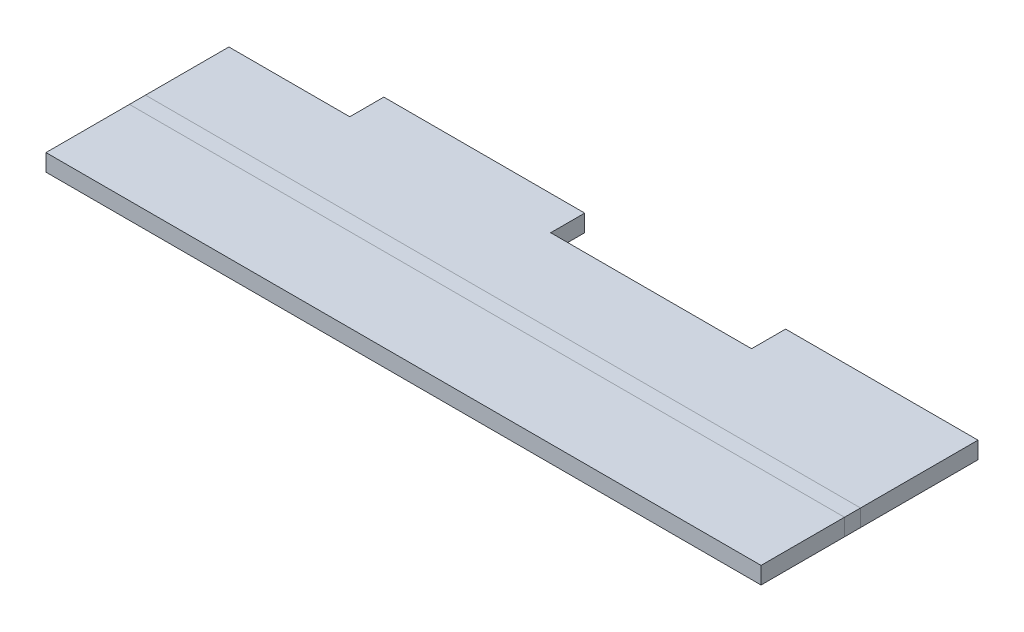
ISO-10303-21;
HEADER;
FILE_DESCRIPTION(('STEP AP214'),'2;1');
FILE_NAME('part.step','',(''),(''),'','','');
FILE_SCHEMA(('AUTOMOTIVE_DESIGN { 1 0 10303 214 1 1 1 1 }'));
ENDSEC;
DATA;
#1=APPLICATION_CONTEXT('core data for automotive mechanical design processes');
#2=APPLICATION_PROTOCOL_DEFINITION('international standard','automotive_design',2000,#1);
#3=PRODUCT_CONTEXT('',#1,'mechanical');
#4=PRODUCT('Part','Part','',(#3));
#5=PRODUCT_RELATED_PRODUCT_CATEGORY('part','',(#4));
#6=PRODUCT_DEFINITION_FORMATION('','',#4);
#7=PRODUCT_DEFINITION_CONTEXT('part definition',#1,'design');
#8=PRODUCT_DEFINITION('design','',#6,#7);
#9=PRODUCT_DEFINITION_SHAPE('','',#8);
#10=(LENGTH_UNIT() NAMED_UNIT(*) SI_UNIT(.MILLI.,.METRE.));
#11=(NAMED_UNIT(*) PLANE_ANGLE_UNIT() SI_UNIT($,.RADIAN.));
#12=(NAMED_UNIT(*) SI_UNIT($,.STERADIAN.) SOLID_ANGLE_UNIT());
#13=UNCERTAINTY_MEASURE_WITH_UNIT(LENGTH_MEASURE(1.E-05),#10,'distance_accuracy_value','');
#14=(GEOMETRIC_REPRESENTATION_CONTEXT(3) GLOBAL_UNCERTAINTY_ASSIGNED_CONTEXT((#13)) GLOBAL_UNIT_ASSIGNED_CONTEXT((#10,
#11,#12)) REPRESENTATION_CONTEXT('',''));
#15=CARTESIAN_POINT('',(0.,0.,0.));
#16=DIRECTION('',(0.,0.,1.));
#17=DIRECTION('',(1.,0.,0.));
#18=AXIS2_PLACEMENT_3D('',#15,#16,#17);
#19=CARTESIAN_POINT('',(5.334,2.032,-1.96658936020354));
#20=DIRECTION('',(1.,0.,0.));
#21=DIRECTION('',(0.,0.,1.));
#22=AXIS2_PLACEMENT_3D('',#19,#20,#21);
#23=PLANE('',#22);
#24=DIRECTION('',(0.,1.,0.));
#25=VECTOR('',#24,1.);
#26=CARTESIAN_POINT('',(5.334,2.032,-0.213989360203542));
#27=LINE('',#26,#25);
#28=CARTESIAN_POINT('',(5.334,1.778,-0.213989360203542));
#29=VERTEX_POINT('',#28);
#30=CARTESIAN_POINT('',(5.334,2.032,-0.213989360203542));
#31=VERTEX_POINT('',#30);
#32=EDGE_CURVE('E11',#29,#31,#27,.T.);
#33=ORIENTED_EDGE('',*,*,#32,.F.);
#34=DIRECTION('',(0.,0.,1.));
#35=VECTOR('',#34,1.);
#36=CARTESIAN_POINT('',(5.334,1.778,-1.96658936020354));
#37=LINE('',#36,#35);
#38=CARTESIAN_POINT('',(5.334,1.778,-1.96658936020354));
#39=VERTEX_POINT('',#38);
#40=EDGE_CURVE('E55',#39,#29,#37,.T.);
#41=ORIENTED_EDGE('',*,*,#40,.F.);
#42=DIRECTION('',(0.,1.,0.));
#43=VECTOR('',#42,1.);
#44=CARTESIAN_POINT('',(5.334,2.032,-1.96658936020354));
#45=LINE('',#44,#43);
#46=CARTESIAN_POINT('',(5.334,2.032,-1.96658936020354));
#47=VERTEX_POINT('',#46);
#48=EDGE_CURVE('E265',#39,#47,#45,.T.);
#49=ORIENTED_EDGE('',*,*,#48,.T.);
#50=DIRECTION('',(0.,0.,1.));
#51=VECTOR('',#50,1.);
#52=CARTESIAN_POINT('',(5.334,2.032,-1.96658936020354));
#53=LINE('',#52,#51);
#54=EDGE_CURVE('E214',#47,#31,#53,.T.);
#55=ORIENTED_EDGE('',*,*,#54,.T.);
#56=EDGE_LOOP('',(#33,#41,#49,#55));
#57=FACE_BOUND('',#56,.T.);
#58=ADVANCED_FACE('F41',(#57),#23,.T.);
#59=CARTESIAN_POINT('',(5.334,2.032,-1.96658936020354));
#60=DIRECTION('',(0.,0.,1.));
#61=DIRECTION('',(-1.,0.,0.));
#62=AXIS2_PLACEMENT_3D('',#59,#60,#61);
#63=PLANE('',#62);
#64=ORIENTED_EDGE('',*,*,#48,.F.);
#65=DIRECTION('',(1.,0.,0.));
#66=VECTOR('',#65,1.);
#67=CARTESIAN_POINT('',(5.334,1.778,-1.96658936020354));
#68=LINE('',#67,#66);
#69=CARTESIAN_POINT('',(2.46380000000005,1.778,-1.96658936020354));
#70=VERTEX_POINT('',#69);
#71=EDGE_CURVE('E247',#39,#70,#68,.F.);
#72=ORIENTED_EDGE('',*,*,#71,.T.);
#73=DIRECTION('',(0.,1.,0.));
#74=VECTOR('',#73,1.);
#75=CARTESIAN_POINT('',(2.46380000000005,2.032,-1.96658936020354));
#76=LINE('',#75,#74);
#77=CARTESIAN_POINT('',(2.46380000000005,2.032,-1.96658936020354));
#78=VERTEX_POINT('',#77);
#79=EDGE_CURVE('E263',#70,#78,#76,.T.);
#80=ORIENTED_EDGE('',*,*,#79,.T.);
#81=DIRECTION('',(-1.,0.,0.));
#82=VECTOR('',#81,1.);
#83=CARTESIAN_POINT('',(5.334,2.032,-1.96658936020354));
#84=LINE('',#83,#82);
#85=EDGE_CURVE('E217',#47,#78,#84,.T.);
#86=ORIENTED_EDGE('',*,*,#85,.F.);
#87=EDGE_LOOP('',(#64,#72,#80,#86));
#88=FACE_BOUND('',#87,.T.);
#89=ADVANCED_FACE('F298',(#88),#63,.F.);
#90=CARTESIAN_POINT('',(2.46380000000005,2.032,-1.96658936020354));
#91=DIRECTION('',(-1.,0.,0.));
#92=DIRECTION('',(0.,0.,-1.));
#93=AXIS2_PLACEMENT_3D('',#90,#91,#92);
#94=PLANE('',#93);
#95=ORIENTED_EDGE('',*,*,#79,.F.);
#96=DIRECTION('',(0.,0.,1.));
#97=VECTOR('',#96,1.);
#98=CARTESIAN_POINT('',(2.46380000000005,1.778,-1.96658936020354));
#99=LINE('',#98,#97);
#100=CARTESIAN_POINT('',(2.46380000000005,1.778,-1.45858936020354));
#101=VERTEX_POINT('',#100);
#102=EDGE_CURVE('E244',#101,#70,#99,.F.);
#103=ORIENTED_EDGE('',*,*,#102,.F.);
#104=DIRECTION('',(0.,1.,0.));
#105=VECTOR('',#104,1.);
#106=CARTESIAN_POINT('',(2.46380000000005,2.032,-1.45858936020354));
#107=LINE('',#106,#105);
#108=CARTESIAN_POINT('',(2.46380000000005,2.032,-1.45858936020354));
#109=VERTEX_POINT('',#108);
#110=EDGE_CURVE('E261',#101,#109,#107,.T.);
#111=ORIENTED_EDGE('',*,*,#110,.T.);
#112=DIRECTION('',(0.,0.,-1.));
#113=VECTOR('',#112,1.);
#114=CARTESIAN_POINT('',(2.46380000000005,2.032,-1.96658936020354));
#115=LINE('',#114,#113);
#116=EDGE_CURVE('E220',#109,#78,#115,.T.);
#117=ORIENTED_EDGE('',*,*,#116,.T.);
#118=EDGE_LOOP('',(#95,#103,#111,#117));
#119=FACE_BOUND('',#118,.T.);
#120=ADVANCED_FACE('F303',(#119),#94,.T.);
#121=CARTESIAN_POINT('',(2.46380000000005,2.032,-1.45858936020354));
#122=DIRECTION('',(0.,0.,-1.));
#123=DIRECTION('',(1.,0.,0.));
#124=AXIS2_PLACEMENT_3D('',#121,#122,#123);
#125=PLANE('',#124);
#126=ORIENTED_EDGE('',*,*,#110,.F.);
#127=DIRECTION('',(1.,0.,0.));
#128=VECTOR('',#127,1.);
#129=CARTESIAN_POINT('',(5.334,1.778,-1.45858936020354));
#130=LINE('',#129,#128);
#131=CARTESIAN_POINT('',(-0.53339999999995,1.778,-1.45858936020354));
#132=VERTEX_POINT('',#131);
#133=EDGE_CURVE('E241',#132,#101,#130,.T.);
#134=ORIENTED_EDGE('',*,*,#133,.F.);
#135=DIRECTION('',(0.,1.,0.));
#136=VECTOR('',#135,1.);
#137=CARTESIAN_POINT('',(-0.53339999999995,2.032,-1.45858936020354));
#138=LINE('',#137,#136);
#139=CARTESIAN_POINT('',(-0.53339999999995,2.032,-1.45858936020354));
#140=VERTEX_POINT('',#139);
#141=EDGE_CURVE('E259',#132,#140,#138,.T.);
#142=ORIENTED_EDGE('',*,*,#141,.T.);
#143=DIRECTION('',(1.,0.,0.));
#144=VECTOR('',#143,1.);
#145=CARTESIAN_POINT('',(2.46380000000005,2.032,-1.45858936020354));
#146=LINE('',#145,#144);
#147=EDGE_CURVE('E224',#140,#109,#146,.T.);
#148=ORIENTED_EDGE('',*,*,#147,.T.);
#149=EDGE_LOOP('',(#126,#134,#142,#148));
#150=FACE_BOUND('',#149,.T.);
#151=ADVANCED_FACE('F318',(#150),#125,.T.);
#152=CARTESIAN_POINT('',(-0.53339999999995,2.032,-1.96658936020354));
#153=DIRECTION('',(1.,0.,0.));
#154=DIRECTION('',(0.,0.,1.));
#155=AXIS2_PLACEMENT_3D('',#152,#153,#154);
#156=PLANE('',#155);
#157=ORIENTED_EDGE('',*,*,#141,.F.);
#158=DIRECTION('',(0.,0.,1.));
#159=VECTOR('',#158,1.);
#160=CARTESIAN_POINT('',(-0.53339999999995,1.778,-1.96658936020354));
#161=LINE('',#160,#159);
#162=CARTESIAN_POINT('',(-0.53339999999995,1.778,-1.96658936020354));
#163=VERTEX_POINT('',#162);
#164=EDGE_CURVE('E238',#163,#132,#161,.T.);
#165=ORIENTED_EDGE('',*,*,#164,.F.);
#166=DIRECTION('',(0.,1.,0.));
#167=VECTOR('',#166,1.);
#168=CARTESIAN_POINT('',(-0.53339999999995,2.032,-1.96658936020354));
#169=LINE('',#168,#167);
#170=CARTESIAN_POINT('',(-0.53339999999995,2.032,-1.96658936020354));
#171=VERTEX_POINT('',#170);
#172=EDGE_CURVE('E257',#163,#171,#169,.T.);
#173=ORIENTED_EDGE('',*,*,#172,.T.);
#174=DIRECTION('',(0.,0.,1.));
#175=VECTOR('',#174,1.);
#176=CARTESIAN_POINT('',(-0.53339999999995,2.032,-1.96658936020354));
#177=LINE('',#176,#175);
#178=EDGE_CURVE('E227',#171,#140,#177,.T.);
#179=ORIENTED_EDGE('',*,*,#178,.T.);
#180=EDGE_LOOP('',(#157,#165,#173,#179));
#181=FACE_BOUND('',#180,.T.);
#182=ADVANCED_FACE('F324',(#181),#156,.T.);
#183=ORIENTED_EDGE('',*,*,#172,.F.);
#184=DIRECTION('',(1.,0.,0.));
#185=VECTOR('',#184,1.);
#186=CARTESIAN_POINT('',(5.334,1.778,-1.96658936020354));
#187=LINE('',#186,#185);
#188=CARTESIAN_POINT('',(-3.53059999999995,1.778,-1.96658936020354));
#189=VERTEX_POINT('',#188);
#190=EDGE_CURVE('E209',#163,#189,#187,.F.);
#191=ORIENTED_EDGE('',*,*,#190,.T.);
#192=DIRECTION('',(0.,1.,0.));
#193=VECTOR('',#192,1.);
#194=CARTESIAN_POINT('',(-3.53059999999995,2.032,-1.96658936020354));
#195=LINE('',#194,#193);
#196=CARTESIAN_POINT('',(-3.53059999999995,2.032,-1.96658936020354));
#197=VERTEX_POINT('',#196);
#198=EDGE_CURVE('E255',#189,#197,#195,.T.);
#199=ORIENTED_EDGE('',*,*,#198,.T.);
#200=EDGE_CURVE('E221',#171,#197,#84,.T.);
#201=ORIENTED_EDGE('',*,*,#200,.F.);
#202=EDGE_LOOP('',(#183,#191,#199,#201));
#203=FACE_BOUND('',#202,.T.);
#204=ADVANCED_FACE('F306',(#203),#63,.F.);
#205=CARTESIAN_POINT('',(-3.53059999999995,2.032,-1.96658936020354));
#206=DIRECTION('',(-1.,0.,0.));
#207=DIRECTION('',(0.,0.,-1.));
#208=AXIS2_PLACEMENT_3D('',#205,#206,#207);
#209=PLANE('',#208);
#210=ORIENTED_EDGE('',*,*,#198,.F.);
#211=DIRECTION('',(0.,0.,1.));
#212=VECTOR('',#211,1.);
#213=CARTESIAN_POINT('',(-3.53059999999995,1.778,-1.96658936020354));
#214=LINE('',#213,#212);
#215=CARTESIAN_POINT('',(-3.53059999999995,1.778,-1.45858936020354));
#216=VERTEX_POINT('',#215);
#217=EDGE_CURVE('E191',#216,#189,#214,.F.);
#218=ORIENTED_EDGE('',*,*,#217,.F.);
#219=DIRECTION('',(0.,1.,0.));
#220=VECTOR('',#219,1.);
#221=CARTESIAN_POINT('',(-3.53059999999995,2.032,-1.45858936020354));
#222=LINE('',#221,#220);
#223=CARTESIAN_POINT('',(-3.53059999999995,2.032,-1.45858936020354));
#224=VERTEX_POINT('',#223);
#225=EDGE_CURVE('E253',#216,#224,#222,.T.);
#226=ORIENTED_EDGE('',*,*,#225,.T.);
#227=DIRECTION('',(0.,0.,-1.));
#228=VECTOR('',#227,1.);
#229=CARTESIAN_POINT('',(-3.53059999999995,2.032,-1.96658936020354));
#230=LINE('',#229,#228);
#231=EDGE_CURVE('E205',#224,#197,#230,.T.);
#232=ORIENTED_EDGE('',*,*,#231,.T.);
#233=EDGE_LOOP('',(#210,#218,#226,#232));
#234=FACE_BOUND('',#233,.T.);
#235=ADVANCED_FACE('F328',(#234),#209,.T.);
#236=CARTESIAN_POINT('',(-5.334,2.032,-1.45858936020354));
#237=DIRECTION('',(0.,0.,-1.));
#238=DIRECTION('',(1.,0.,0.));
#239=AXIS2_PLACEMENT_3D('',#236,#237,#238);
#240=PLANE('',#239);
#241=ORIENTED_EDGE('',*,*,#225,.F.);
#242=DIRECTION('',(1.,0.,0.));
#243=VECTOR('',#242,1.);
#244=CARTESIAN_POINT('',(5.334,1.778,-1.45858936020354));
#245=LINE('',#244,#243);
#246=CARTESIAN_POINT('',(-5.334,1.778,-1.45858936020354));
#247=VERTEX_POINT('',#246);
#248=EDGE_CURVE('E231',#247,#216,#245,.T.);
#249=ORIENTED_EDGE('',*,*,#248,.F.);
#250=DIRECTION('',(0.,1.,0.));
#251=VECTOR('',#250,1.);
#252=CARTESIAN_POINT('',(-5.334,2.032,-1.45858936020354));
#253=LINE('',#252,#251);
#254=CARTESIAN_POINT('',(-5.334,2.032,-1.45858936020354));
#255=VERTEX_POINT('',#254);
#256=EDGE_CURVE('E251',#247,#255,#253,.T.);
#257=ORIENTED_EDGE('',*,*,#256,.T.);
#258=DIRECTION('',(1.,0.,0.));
#259=VECTOR('',#258,1.);
#260=CARTESIAN_POINT('',(-5.334,2.032,-1.45858936020354));
#261=LINE('',#260,#259);
#262=EDGE_CURVE('E208',#255,#224,#261,.T.);
#263=ORIENTED_EDGE('',*,*,#262,.T.);
#264=EDGE_LOOP('',(#241,#249,#257,#263));
#265=FACE_BOUND('',#264,.T.);
#266=ADVANCED_FACE('F331',(#265),#240,.T.);
#267=CARTESIAN_POINT('',(-5.334,2.032,-1.96658936020354));
#268=DIRECTION('',(1.,0.,0.));
#269=DIRECTION('',(0.,0.,1.));
#270=AXIS2_PLACEMENT_3D('',#267,#268,#269);
#271=PLANE('',#270);
#272=ORIENTED_EDGE('',*,*,#256,.F.);
#273=DIRECTION('',(0.,0.,1.));
#274=VECTOR('',#273,1.);
#275=CARTESIAN_POINT('',(-5.334,1.778,-1.96658936020354));
#276=LINE('',#275,#274);
#277=CARTESIAN_POINT('',(-5.334,1.778,-0.213989360203542));
#278=VERTEX_POINT('',#277);
#279=EDGE_CURVE('E63',#247,#278,#276,.T.);
#280=ORIENTED_EDGE('',*,*,#279,.T.);
#281=DIRECTION('',(0.,1.,0.));
#282=VECTOR('',#281,1.);
#283=CARTESIAN_POINT('',(-5.334,2.032,-0.213989360203542));
#284=LINE('',#283,#282);
#285=CARTESIAN_POINT('',(-5.334,2.032,-0.213989360203542));
#286=VERTEX_POINT('',#285);
#287=EDGE_CURVE('E268',#278,#286,#284,.T.);
#288=ORIENTED_EDGE('',*,*,#287,.T.);
#289=DIRECTION('',(0.,0.,1.));
#290=VECTOR('',#289,1.);
#291=CARTESIAN_POINT('',(-5.334,2.032,-1.96658936020354));
#292=LINE('',#291,#290);
#293=EDGE_CURVE('E212',#255,#286,#292,.T.);
#294=ORIENTED_EDGE('',*,*,#293,.F.);
#295=EDGE_LOOP('',(#272,#280,#288,#294));
#296=FACE_BOUND('',#295,.T.);
#297=ADVANCED_FACE('F332',(#296),#271,.F.);
#298=CARTESIAN_POINT('',(5.334,2.032,-1.96658936020354));
#299=DIRECTION('',(0.,-1.,0.));
#300=DIRECTION('',(1.,0.,0.));
#301=AXIS2_PLACEMENT_3D('',#298,#299,#300);
#302=PLANE('',#301);
#303=ORIENTED_EDGE('',*,*,#231,.F.);
#304=ORIENTED_EDGE('',*,*,#262,.F.);
#305=ORIENTED_EDGE('',*,*,#293,.T.);
#306=DIRECTION('',(-1.,0.,0.));
#307=VECTOR('',#306,1.);
#308=CARTESIAN_POINT('',(5.334,2.032,-0.213989360203542));
#309=LINE('',#308,#307);
#310=EDGE_CURVE('E181',#31,#286,#309,.T.);
#311=ORIENTED_EDGE('',*,*,#310,.F.);
#312=ORIENTED_EDGE('',*,*,#54,.F.);
#313=ORIENTED_EDGE('',*,*,#85,.T.);
#314=ORIENTED_EDGE('',*,*,#116,.F.);
#315=ORIENTED_EDGE('',*,*,#147,.F.);
#316=ORIENTED_EDGE('',*,*,#178,.F.);
#317=ORIENTED_EDGE('',*,*,#200,.T.);
#318=EDGE_LOOP('',(#303,#304,#305,#311,#312,#313,#314,#315,#316,#317));
#319=FACE_BOUND('',#318,.T.);
#320=ADVANCED_FACE('F294',(#319),#302,.F.);
#321=CARTESIAN_POINT('',(5.334,1.778,-1.96658936020354));
#322=DIRECTION('',(0.,-1.,0.));
#323=DIRECTION('',(1.,0.,0.));
#324=AXIS2_PLACEMENT_3D('',#321,#322,#323);
#325=PLANE('',#324);
#326=ORIENTED_EDGE('',*,*,#217,.T.);
#327=ORIENTED_EDGE('',*,*,#190,.F.);
#328=ORIENTED_EDGE('',*,*,#164,.T.);
#329=ORIENTED_EDGE('',*,*,#133,.T.);
#330=ORIENTED_EDGE('',*,*,#102,.T.);
#331=ORIENTED_EDGE('',*,*,#71,.F.);
#332=ORIENTED_EDGE('',*,*,#40,.T.);
#333=DIRECTION('',(-1.,0.,0.));
#334=VECTOR('',#333,1.);
#335=CARTESIAN_POINT('',(5.334,1.778,-0.213989360203542));
#336=LINE('',#335,#334);
#337=EDGE_CURVE('E48',#29,#278,#336,.T.);
#338=ORIENTED_EDGE('',*,*,#337,.T.);
#339=ORIENTED_EDGE('',*,*,#279,.F.);
#340=ORIENTED_EDGE('',*,*,#248,.T.);
#341=EDGE_LOOP('',(#326,#327,#328,#329,#330,#331,#332,#338,#339,#340));
#342=FACE_BOUND('',#341,.T.);
#343=ADVANCED_FACE('F270',(#342),#325,.T.);
#344=CARTESIAN_POINT('',(5.334,2.032,1.27));
#345=DIRECTION('',(0.,0.,1.));
#346=DIRECTION('',(-1.,0.,0.));
#347=AXIS2_PLACEMENT_3D('',#344,#345,#346);
#348=PLANE('',#347);
#349=DIRECTION('',(0.,1.,0.));
#350=VECTOR('',#349,1.);
#351=CARTESIAN_POINT('',(-5.334,2.032,1.27));
#352=LINE('',#351,#350);
#353=CARTESIAN_POINT('',(-5.334,1.778,1.27));
#354=VERTEX_POINT('',#353);
#355=CARTESIAN_POINT('',(-5.334,2.032,1.27));
#356=VERTEX_POINT('',#355);
#357=EDGE_CURVE('E165',#354,#356,#352,.T.);
#358=ORIENTED_EDGE('',*,*,#357,.F.);
#359=DIRECTION('',(1.,0.,0.));
#360=VECTOR('',#359,1.);
#361=CARTESIAN_POINT('',(5.334,1.778,1.27));
#362=LINE('',#361,#360);
#363=CARTESIAN_POINT('',(5.334,1.778,1.27));
#364=VERTEX_POINT('',#363);
#365=EDGE_CURVE('E194',#364,#354,#362,.F.);
#366=ORIENTED_EDGE('',*,*,#365,.F.);
#367=DIRECTION('',(0.,1.,0.));
#368=VECTOR('',#367,1.);
#369=CARTESIAN_POINT('',(5.334,2.032,1.27));
#370=LINE('',#369,#368);
#371=CARTESIAN_POINT('',(5.334,2.032,1.27));
#372=VERTEX_POINT('',#371);
#373=EDGE_CURVE('E177',#364,#372,#370,.T.);
#374=ORIENTED_EDGE('',*,*,#373,.T.);
#375=DIRECTION('',(-1.,0.,0.));
#376=VECTOR('',#375,1.);
#377=CARTESIAN_POINT('',(5.334,2.032,1.27));
#378=LINE('',#377,#376);
#379=EDGE_CURVE('E166',#372,#356,#378,.T.);
#380=ORIENTED_EDGE('',*,*,#379,.T.);
#381=EDGE_LOOP('',(#358,#366,#374,#380));
#382=FACE_BOUND('',#381,.T.);
#383=ADVANCED_FACE('F286',(#382),#348,.T.);
#384=CARTESIAN_POINT('',(5.334,2.032,0.0254000000000001));
#385=DIRECTION('',(0.,-1.,0.));
#386=DIRECTION('',(0.,0.,-1.));
#387=AXIS2_PLACEMENT_3D('',#384,#385,#386);
#388=PLANE('',#387);
#389=DIRECTION('',(0.,0.,1.));
#390=VECTOR('',#389,1.);
#391=CARTESIAN_POINT('',(-5.334,2.032,0.0254000000000001));
#392=LINE('',#391,#390);
#393=CARTESIAN_POINT('',(-5.334,2.032,0.0254));
#394=VERTEX_POINT('',#393);
#395=EDGE_CURVE('E147',#394,#356,#392,.T.);
#396=ORIENTED_EDGE('',*,*,#395,.T.);
#397=ORIENTED_EDGE('',*,*,#379,.F.);
#398=DIRECTION('',(0.,0.,1.));
#399=VECTOR('',#398,1.);
#400=CARTESIAN_POINT('',(5.334,2.032,0.0254000000000001));
#401=LINE('',#400,#399);
#402=CARTESIAN_POINT('',(5.334,2.032,0.0254000000000001));
#403=VERTEX_POINT('',#402);
#404=EDGE_CURVE('E150',#403,#372,#401,.T.);
#405=ORIENTED_EDGE('',*,*,#404,.F.);
#406=DIRECTION('',(-1.,0.,0.));
#407=VECTOR('',#406,1.);
#408=CARTESIAN_POINT('',(5.334,2.032,0.0254000000000001));
#409=LINE('',#408,#407);
#410=EDGE_CURVE('E143',#403,#394,#409,.T.);
#411=ORIENTED_EDGE('',*,*,#410,.T.);
#412=EDGE_LOOP('',(#396,#397,#405,#411));
#413=FACE_BOUND('',#412,.T.);
#414=ADVANCED_FACE('F145',(#413),#388,.F.);
#415=CARTESIAN_POINT('',(-5.334,2.032,0.0254000000000001));
#416=DIRECTION('',(1.,0.,0.));
#417=DIRECTION('',(0.,0.,1.));
#418=AXIS2_PLACEMENT_3D('',#415,#416,#417);
#419=PLANE('',#418);
#420=DIRECTION('',(0.,0.,-1.));
#421=VECTOR('',#420,1.);
#422=CARTESIAN_POINT('',(-5.334,1.778,0.0254));
#423=LINE('',#422,#421);
#424=CARTESIAN_POINT('',(-5.334,1.778,0.0254));
#425=VERTEX_POINT('',#424);
#426=EDGE_CURVE('E156',#425,#354,#423,.F.);
#427=ORIENTED_EDGE('',*,*,#426,.T.);
#428=ORIENTED_EDGE('',*,*,#357,.T.);
#429=ORIENTED_EDGE('',*,*,#395,.F.);
#430=DIRECTION('',(0.,1.,0.));
#431=VECTOR('',#430,1.);
#432=CARTESIAN_POINT('',(-5.334,2.032,0.0254000000000001));
#433=LINE('',#432,#431);
#434=EDGE_CURVE('E163',#425,#394,#433,.T.);
#435=ORIENTED_EDGE('',*,*,#434,.F.);
#436=EDGE_LOOP('',(#427,#428,#429,#435));
#437=FACE_BOUND('',#436,.T.);
#438=ADVANCED_FACE('F162',(#437),#419,.F.);
#439=CARTESIAN_POINT('',(5.334,1.778,0.0254));
#440=DIRECTION('',(0.,-1.,0.));
#441=DIRECTION('',(0.,0.,-1.));
#442=AXIS2_PLACEMENT_3D('',#439,#440,#441);
#443=PLANE('',#442);
#444=ORIENTED_EDGE('',*,*,#426,.F.);
#445=DIRECTION('',(-1.,0.,0.));
#446=VECTOR('',#445,1.);
#447=CARTESIAN_POINT('',(5.334,1.778,0.0254));
#448=LINE('',#447,#446);
#449=CARTESIAN_POINT('',(5.334,1.778,0.0254));
#450=VERTEX_POINT('',#449);
#451=EDGE_CURVE('E178',#450,#425,#448,.T.);
#452=ORIENTED_EDGE('',*,*,#451,.F.);
#453=DIRECTION('',(0.,0.,-1.));
#454=VECTOR('',#453,1.);
#455=CARTESIAN_POINT('',(5.334,1.778,0.0254));
#456=LINE('',#455,#454);
#457=EDGE_CURVE('E197',#450,#364,#456,.F.);
#458=ORIENTED_EDGE('',*,*,#457,.T.);
#459=ORIENTED_EDGE('',*,*,#365,.T.);
#460=EDGE_LOOP('',(#444,#452,#458,#459));
#461=FACE_BOUND('',#460,.T.);
#462=ADVANCED_FACE('F279',(#461),#443,.T.);
#463=CARTESIAN_POINT('',(5.334,2.032,0.0254000000000001));
#464=DIRECTION('',(1.,0.,0.));
#465=DIRECTION('',(0.,0.,1.));
#466=AXIS2_PLACEMENT_3D('',#463,#464,#465);
#467=PLANE('',#466);
#468=ORIENTED_EDGE('',*,*,#373,.F.);
#469=ORIENTED_EDGE('',*,*,#457,.F.);
#470=DIRECTION('',(0.,1.,0.));
#471=VECTOR('',#470,1.);
#472=CARTESIAN_POINT('',(5.334,2.032,0.0254000000000001));
#473=LINE('',#472,#471);
#474=EDGE_CURVE('E192',#450,#403,#473,.T.);
#475=ORIENTED_EDGE('',*,*,#474,.T.);
#476=ORIENTED_EDGE('',*,*,#404,.T.);
#477=EDGE_LOOP('',(#468,#469,#475,#476));
#478=FACE_BOUND('',#477,.T.);
#479=ADVANCED_FACE('F284',(#478),#467,.T.);
#480=CARTESIAN_POINT('',(-5.334,2.032,-0.213989360203542));
#481=DIRECTION('',(-1.,0.,0.));
#482=DIRECTION('',(0.,0.,1.));
#483=AXIS2_PLACEMENT_3D('',#480,#481,#482);
#484=PLANE('',#483);
#485=ORIENTED_EDGE('',*,*,#287,.F.);
#486=DIRECTION('',(0.,0.,1.));
#487=VECTOR('',#486,1.);
#488=CARTESIAN_POINT('',(-5.334,1.778,-0.0942946801017711));
#489=LINE('',#488,#487);
#490=EDGE_CURVE('E176',#278,#425,#489,.T.);
#491=ORIENTED_EDGE('',*,*,#490,.T.);
#492=ORIENTED_EDGE('',*,*,#434,.T.);
#493=DIRECTION('',(0.,0.,1.));
#494=VECTOR('',#493,1.);
#495=CARTESIAN_POINT('',(-5.334,2.032,-0.213989360203542));
#496=LINE('',#495,#494);
#497=EDGE_CURVE('E173',#286,#394,#496,.T.);
#498=ORIENTED_EDGE('',*,*,#497,.F.);
#499=EDGE_LOOP('',(#485,#491,#492,#498));
#500=FACE_BOUND('',#499,.T.);
#501=ADVANCED_FACE('F172',(#500),#484,.T.);
#502=CARTESIAN_POINT('',(5.334,2.032,-0.213989360203542));
#503=DIRECTION('',(1.,0.,0.));
#504=DIRECTION('',(0.,0.,-1.));
#505=AXIS2_PLACEMENT_3D('',#502,#503,#504);
#506=PLANE('',#505);
#507=ORIENTED_EDGE('',*,*,#474,.F.);
#508=DIRECTION('',(0.,0.,1.));
#509=VECTOR('',#508,1.);
#510=CARTESIAN_POINT('',(5.334,1.778,-0.0942946801017711));
#511=LINE('',#510,#509);
#512=EDGE_CURVE('E183',#450,#29,#511,.F.);
#513=ORIENTED_EDGE('',*,*,#512,.T.);
#514=ORIENTED_EDGE('',*,*,#32,.T.);
#515=DIRECTION('',(0.,0.,-1.));
#516=VECTOR('',#515,1.);
#517=CARTESIAN_POINT('',(5.334,2.032,-0.213989360203542));
#518=LINE('',#517,#516);
#519=EDGE_CURVE('E182',#403,#31,#518,.T.);
#520=ORIENTED_EDGE('',*,*,#519,.F.);
#521=EDGE_LOOP('',(#507,#513,#514,#520));
#522=FACE_BOUND('',#521,.T.);
#523=ADVANCED_FACE('F282',(#522),#506,.T.);
#524=CARTESIAN_POINT('',(0.,2.032,-0.0942946801017711));
#525=DIRECTION('',(0.,1.,0.));
#526=DIRECTION('',(0.,0.,1.));
#527=AXIS2_PLACEMENT_3D('',#524,#525,#526);
#528=PLANE('',#527);
#529=ORIENTED_EDGE('',*,*,#519,.T.);
#530=ORIENTED_EDGE('',*,*,#310,.T.);
#531=ORIENTED_EDGE('',*,*,#497,.T.);
#532=ORIENTED_EDGE('',*,*,#410,.F.);
#533=EDGE_LOOP('',(#529,#530,#531,#532));
#534=FACE_BOUND('',#533,.T.);
#535=ADVANCED_FACE('F180',(#534),#528,.T.);
#536=CARTESIAN_POINT('',(0.,1.778,-0.0942946801017711));
#537=DIRECTION('',(0.,1.,0.));
#538=DIRECTION('',(0.,0.,1.));
#539=AXIS2_PLACEMENT_3D('',#536,#537,#538);
#540=PLANE('',#539);
#541=ORIENTED_EDGE('',*,*,#512,.F.);
#542=ORIENTED_EDGE('',*,*,#451,.T.);
#543=ORIENTED_EDGE('',*,*,#490,.F.);
#544=ORIENTED_EDGE('',*,*,#337,.F.);
#545=EDGE_LOOP('',(#541,#542,#543,#544));
#546=FACE_BOUND('',#545,.T.);
#547=ADVANCED_FACE('F275',(#546),#540,.F.);
#548=CLOSED_SHELL('',(#58,#89,#120,#151,#182,#204,#235,#266,#297,#320,#343,#383,#414,#438,#462,
#479,#501,#523,#535,#547));
#549=MANIFOLD_SOLID_BREP('B2',#548);
#550=ADVANCED_BREP_SHAPE_REPRESENTATION('',(#18,#549),#14);
#551=SHAPE_DEFINITION_REPRESENTATION(#9,#550);
ENDSEC;
END-ISO-10303-21;
